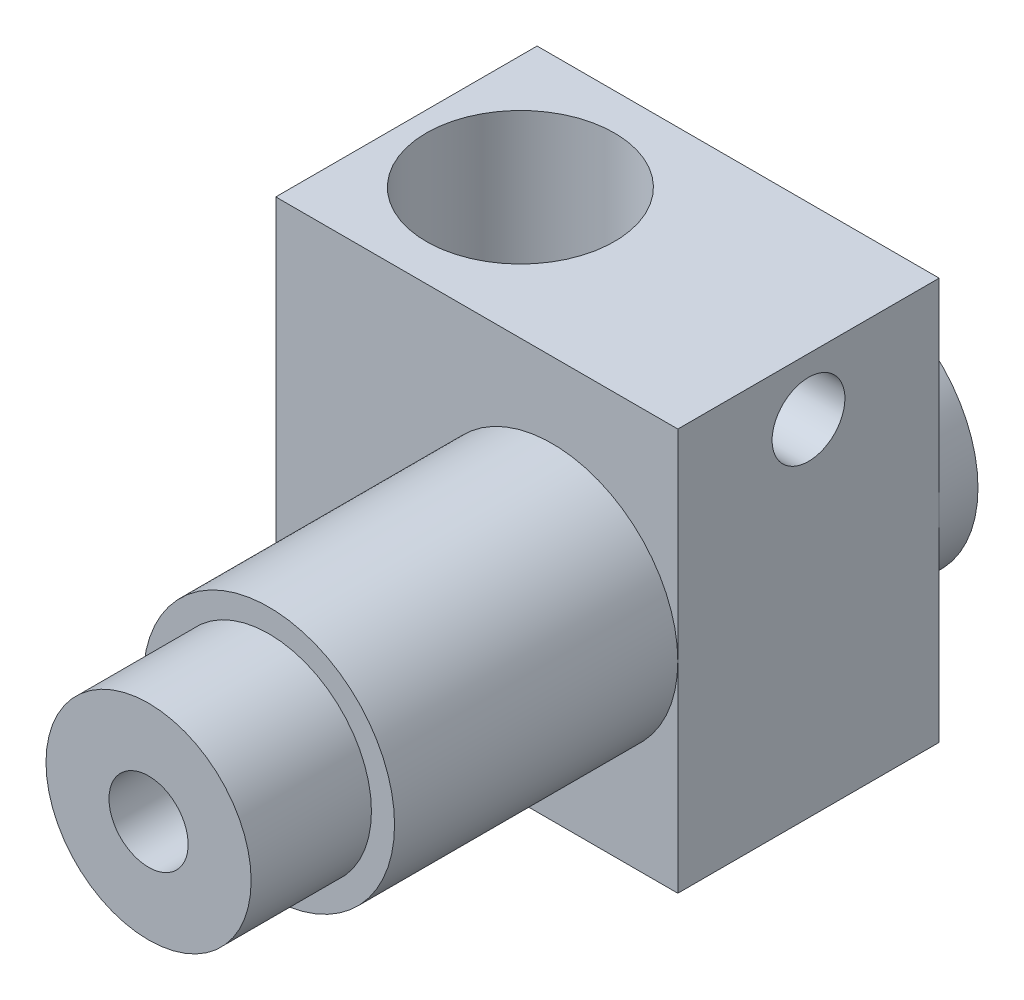
ISO-10303-21;
HEADER;
FILE_DESCRIPTION(('STEP AP214'),'2;1');
FILE_NAME('part.step','',(''),(''),'','','');
FILE_SCHEMA(('AUTOMOTIVE_DESIGN { 1 0 10303 214 1 1 1 1 }'));
ENDSEC;
DATA;
#1=APPLICATION_CONTEXT('core data for automotive mechanical design processes');
#2=APPLICATION_PROTOCOL_DEFINITION('international standard','automotive_design',2000,#1);
#3=PRODUCT_CONTEXT('',#1,'mechanical');
#4=PRODUCT('Part','Part','',(#3));
#5=PRODUCT_RELATED_PRODUCT_CATEGORY('part','',(#4));
#6=PRODUCT_DEFINITION_FORMATION('','',#4);
#7=PRODUCT_DEFINITION_CONTEXT('part definition',#1,'design');
#8=PRODUCT_DEFINITION('design','',#6,#7);
#9=PRODUCT_DEFINITION_SHAPE('','',#8);
#10=(LENGTH_UNIT() NAMED_UNIT(*) SI_UNIT(.MILLI.,.METRE.));
#11=(NAMED_UNIT(*) PLANE_ANGLE_UNIT() SI_UNIT($,.RADIAN.));
#12=(NAMED_UNIT(*) SI_UNIT($,.STERADIAN.) SOLID_ANGLE_UNIT());
#13=UNCERTAINTY_MEASURE_WITH_UNIT(LENGTH_MEASURE(1.E-05),#10,'distance_accuracy_value','');
#14=(GEOMETRIC_REPRESENTATION_CONTEXT(3) GLOBAL_UNCERTAINTY_ASSIGNED_CONTEXT((#13)) GLOBAL_UNIT_ASSIGNED_CONTEXT((#10,
#11,#12)) REPRESENTATION_CONTEXT('',''));
#15=CARTESIAN_POINT('',(0.,0.,0.));
#16=DIRECTION('',(0.,0.,1.));
#17=DIRECTION('',(1.,0.,0.));
#18=AXIS2_PLACEMENT_3D('',#15,#16,#17);
#19=CARTESIAN_POINT('',(-35.4337723682561,8.98403432128964,12.5942984206183));
#20=DIRECTION('',(0.,0.,-1.));
#21=DIRECTION('',(-1.,0.,0.));
#22=AXIS2_PLACEMENT_3D('',#19,#20,#21);
#23=CYLINDRICAL_SURFACE('',#22,1.25);
#24=CARTESIAN_POINT('',(-35.4337723682561,8.98403432128964,33.5972984192473));
#25=DIRECTION('',(0.,0.,-1.));
#26=DIRECTION('',(-1.,0.,0.));
#27=AXIS2_PLACEMENT_3D('',#24,#25,#26);
#28=CIRCLE('',#27,1.25);
#29=CARTESIAN_POINT('',(-36.6837723682561,8.98403432128964,33.5972984192473));
#30=VERTEX_POINT('',#29);
#31=EDGE_CURVE('E39',#30,#30,#28,.F.);
#32=ORIENTED_EDGE('',*,*,#31,.T.);
#33=EDGE_LOOP('',(#32));
#34=FACE_BOUND('',#33,.T.);
#35=CARTESIAN_POINT('',(-35.4337723682561,8.98403432128964,11.2860520131569));
#36=DIRECTION('',(0.,0.,1.));
#37=DIRECTION('',(1.,0.,0.));
#38=AXIS2_PLACEMENT_3D('',#35,#36,#37);
#39=CIRCLE('',#38,1.24999999997044);
#40=CARTESIAN_POINT('',(-34.1837723682857,8.98403432128964,11.2860520131569));
#41=VERTEX_POINT('',#40);
#42=EDGE_CURVE('E139',#41,#41,#39,.F.);
#43=ORIENTED_EDGE('',*,*,#42,.T.);
#44=EDGE_LOOP('',(#43));
#45=FACE_BOUND('',#44,.T.);
#46=ADVANCED_FACE('F36',(#34,#45),#23,.F.);
#47=CARTESIAN_POINT('',(-35.4337723682561,8.98403432128964,11.2860520131569));
#48=DIRECTION('',(0.,0.,1.));
#49=DIRECTION('',(1.,0.,0.));
#50=AXIS2_PLACEMENT_3D('',#47,#48,#49);
#51=CONICAL_SURFACE('',#50,1.24999999997044,0.698131700833495);
#52=CARTESIAN_POINT('',(-35.4337723682561,8.98403432128964,10.0942984206183));
#53=DIRECTION('',(0.,0.,-1.));
#54=DIRECTION('',(-1.,0.,0.));
#55=AXIS2_PLACEMENT_3D('',#52,#53,#54);
#56=CIRCLE('',#55,0.25);
#57=CARTESIAN_POINT('',(-35.1837723683116,8.98403432128964,10.0942984206183));
#58=VERTEX_POINT('',#57);
#59=EDGE_CURVE('E131',#58,#58,#56,.T.);
#60=CARTESIAN_POINT('',(-34.1837723682857,8.98403432128964,11.2860520131569));
#61=CARTESIAN_POINT('',(-34.1941890349526,8.98403432128964,11.2736379132346));
#62=CARTESIAN_POINT('',(-34.2046057016195,8.98403432128964,11.2612238133123));
#63=CARTESIAN_POINT('',(-34.2254390349534,8.98403432128964,11.2363956134678));
#64=CARTESIAN_POINT('',(-34.2358557016204,8.98403432128964,11.2239815135455));
#65=CARTESIAN_POINT('',(-34.2566890349542,8.98403432128964,11.1991533137009));
#66=CARTESIAN_POINT('',(-34.2671057016212,8.98403432128964,11.1867392137786));
#67=CARTESIAN_POINT('',(-34.287939034955,8.98403432128964,11.1619110139341));
#68=CARTESIAN_POINT('',(-34.298355701622,8.98403432128964,11.1494969140118));
#69=CARTESIAN_POINT('',(-34.3191890349558,8.98403432128964,11.1246687141673));
#70=CARTESIAN_POINT('',(-34.3296057016228,8.98403432128964,11.112254614245));
#71=CARTESIAN_POINT('',(-34.3504390349567,8.98403432128964,11.0874264144004));
#72=CARTESIAN_POINT('',(-34.3608557016236,8.98403432128964,11.0750123144782));
#73=CARTESIAN_POINT('',(-34.3816890349575,8.98403432128964,11.0501841146336));
#74=CARTESIAN_POINT('',(-34.3921057016244,8.98403432128964,11.0377700147113));
#75=CARTESIAN_POINT('',(-34.4129390349583,8.98403432128964,11.0129418148668));
#76=CARTESIAN_POINT('',(-34.4233557016252,8.98403432128964,11.0005277149445));
#77=CARTESIAN_POINT('',(-34.4441890349591,8.98403432128964,10.9756995150999));
#78=CARTESIAN_POINT('',(-34.454605701626,8.98403432128964,10.9632854151777));
#79=CARTESIAN_POINT('',(-34.4754390349599,8.98403432128964,10.9384572153331));
#80=CARTESIAN_POINT('',(-34.4858557016268,8.98403432128964,10.9260431154108));
#81=CARTESIAN_POINT('',(-34.5066890349607,8.98403432128964,10.9012149155663));
#82=CARTESIAN_POINT('',(-34.5171057016276,8.98403432128964,10.888800815644));
#83=CARTESIAN_POINT('',(-34.5379390349615,8.98403432128964,10.8639726157994));
#84=CARTESIAN_POINT('',(-34.5483557016285,8.98403432128964,10.8515585158772));
#85=CARTESIAN_POINT('',(-34.5691890349623,8.98403432128964,10.8267303160326));
#86=CARTESIAN_POINT('',(-34.5796057016293,8.98403432128964,10.8143162161103));
#87=CARTESIAN_POINT('',(-34.6004390349631,8.98403432128964,10.7894880162658));
#88=CARTESIAN_POINT('',(-34.6108557016301,8.98403432128964,10.7770739163435));
#89=CARTESIAN_POINT('',(-34.631689034964,8.98403432128964,10.752245716499));
#90=CARTESIAN_POINT('',(-34.6421057016309,8.98403432128964,10.7398316165767));
#91=CARTESIAN_POINT('',(-34.6629390349648,8.98403432128964,10.7150034167321));
#92=CARTESIAN_POINT('',(-34.6733557016317,8.98403432128964,10.7025893168098));
#93=CARTESIAN_POINT('',(-34.6941890349656,8.98403432128964,10.6777611169653));
#94=CARTESIAN_POINT('',(-34.7046057016325,8.98403432128964,10.665347017043));
#95=CARTESIAN_POINT('',(-34.7254390349664,8.98403432128964,10.6405188171985));
#96=CARTESIAN_POINT('',(-34.7358557016333,8.98403432128964,10.6281047172762));
#97=CARTESIAN_POINT('',(-34.7566890349672,8.98403432128964,10.6032765174316));
#98=CARTESIAN_POINT('',(-34.7671057016341,8.98403432128964,10.5908624175094));
#99=CARTESIAN_POINT('',(-34.787939034968,8.98403432128964,10.5660342176648));
#100=CARTESIAN_POINT('',(-34.798355701635,8.98403432128964,10.5536201177425));
#101=CARTESIAN_POINT('',(-34.8191890349688,8.98403432128964,10.528791917898));
#102=CARTESIAN_POINT('',(-34.8296057016358,8.98403432128964,10.5163778179757));
#103=CARTESIAN_POINT('',(-34.8504390349696,8.98403432128964,10.4915496181311));
#104=CARTESIAN_POINT('',(-34.8608557016366,8.98403432128964,10.4791355182089));
#105=CARTESIAN_POINT('',(-34.8816890349704,8.98403432128964,10.4543073183643));
#106=CARTESIAN_POINT('',(-34.8921057016374,8.98403432128964,10.441893218442));
#107=CARTESIAN_POINT('',(-34.9129390349713,8.98403432128964,10.4170650185975));
#108=CARTESIAN_POINT('',(-34.9233557016382,8.98403432128964,10.4046509186752));
#109=CARTESIAN_POINT('',(-34.9441890349721,8.98403432128964,10.3798227188306));
#110=CARTESIAN_POINT('',(-34.954605701639,8.98403432128964,10.3674086189084));
#111=CARTESIAN_POINT('',(-34.9754390349729,8.98403432128964,10.3425804190638));
#112=CARTESIAN_POINT('',(-34.9858557016398,8.98403432128964,10.3301663191415));
#113=CARTESIAN_POINT('',(-35.0066890349737,8.98403432128964,10.305338119297));
#114=CARTESIAN_POINT('',(-35.0171057016406,8.98403432128964,10.2929240193747));
#115=CARTESIAN_POINT('',(-35.0379390349745,8.98403432128964,10.2680958195302));
#116=CARTESIAN_POINT('',(-35.0483557016414,8.98403432128964,10.2556817196079));
#117=CARTESIAN_POINT('',(-35.0691890349753,8.98403432128964,10.2308535197633));
#118=CARTESIAN_POINT('',(-35.0796057016423,8.98403432128964,10.218439419841));
#119=CARTESIAN_POINT('',(-35.1004390349761,8.98403432128964,10.1936112199965));
#120=CARTESIAN_POINT('',(-35.1108557016431,8.98403432128964,10.1811971200742));
#121=CARTESIAN_POINT('',(-35.1316890349769,8.98403432128964,10.1563689202297));
#122=CARTESIAN_POINT('',(-35.1421057016439,8.98403432128964,10.1439548203074));
#123=CARTESIAN_POINT('',(-35.1629390349777,8.98403432128964,10.1191266204628));
#124=CARTESIAN_POINT('',(-35.1733557016447,8.98403432128964,10.1067125205406));
#125=CARTESIAN_POINT('',(-35.1837723683116,8.98403432128964,10.0942984206183));
#126=B_SPLINE_CURVE_WITH_KNOTS('',3,(#60,#61,#62,#63,#64,#65,#66,#67,#68,#69,#70,#71,#72,#73,
#74,#75,#76,#77,#78,#79,#80,#81,#82,#83,#84,#85,#86,#87,#88,#89,#90,#91,#92,#93,#94,#95,#96,#97,
#98,#99,#100,#101,#102,#103,#104,#105,#106,#107,#108,#109,#110,#111,#112,#113,#114,#115,#116,
#117,#118,#119,#120,#121,#122,#123,#124,#125),.UNSPECIFIED.,.F.,.F.,(4,2,2,2,2,2,2,2,2,2,2,2,2,
2,2,2,2,2,2,2,2,2,2,2,2,2,2,2,2,2,2,2,4),(0.,0.0486163695885792,0.0972327391771553,
0.145849108765731,0.194465478354312,0.243081847942888,0.291698217531464,0.340314587120045,
0.388930956708621,0.437547326297201,0.486163695885777,0.534780065474353,0.583396435062934,
0.63201280465151,0.68062917424009,0.729245543828666,0.777861913417242,0.826478283005822,
0.875094652594398,0.923711022182978,0.972327391771554,1.02094376136013,1.06956013094871,
1.11817650053729,1.16679287012587,1.21540923971444,1.26402560930302,1.3126419788916,
1.36125834848018,1.40987471806876,1.45849108765733,1.50710745724591,1.55572382683449),.UNSPECIFIED.);
#127=EDGE_CURVE('BSEAM222',#41,#58,#126,.T.);
#128=ORIENTED_EDGE('',*,*,#42,.F.);
#129=ORIENTED_EDGE('',*,*,#59,.T.);
#130=ORIENTED_EDGE('',*,*,#127,.T.);
#131=ORIENTED_EDGE('',*,*,#127,.F.);
#132=EDGE_LOOP('',(#128,#130,#129,#131));
#133=FACE_BOUND('',#132,.T.);
#134=ADVANCED_FACE('F222',(#133),#51,.F.);
#135=CARTESIAN_POINT('',(-32.1937723682561,8.98403432128964,33.5972984192473));
#136=DIRECTION('',(0.,0.,-1.));
#137=DIRECTION('',(-1.,0.,0.));
#138=AXIS2_PLACEMENT_3D('',#135,#136,#137);
#139=PLANE('',#138);
#140=ORIENTED_EDGE('',*,*,#31,.F.);
#141=EDGE_LOOP('',(#140));
#142=FACE_BOUND('',#141,.T.);
#143=CARTESIAN_POINT('',(-35.4337723682561,8.98403432128964,33.5972984192473));
#144=DIRECTION('',(0.,0.,-1.));
#145=DIRECTION('',(-1.,0.,0.));
#146=AXIS2_PLACEMENT_3D('',#143,#144,#145);
#147=CIRCLE('',#146,3.24);
#148=CARTESIAN_POINT('',(-38.6737723682561,8.98403432128964,33.5972984192473));
#149=VERTEX_POINT('',#148);
#150=EDGE_CURVE('E129',#149,#149,#147,.T.);
#151=ORIENTED_EDGE('',*,*,#150,.F.);
#152=EDGE_LOOP('',(#151));
#153=FACE_BOUND('',#152,.T.);
#154=ADVANCED_FACE('F219',(#142,#153),#139,.F.);
#155=CARTESIAN_POINT('',(-35.4337723682561,8.98403432128964,12.5942984206183));
#156=DIRECTION('',(0.,0.,-1.));
#157=DIRECTION('',(-1.,0.,0.));
#158=AXIS2_PLACEMENT_3D('',#155,#156,#157);
#159=CYLINDRICAL_SURFACE('',#158,0.25);
#160=ORIENTED_EDGE('',*,*,#59,.F.);
#161=EDGE_LOOP('',(#160));
#162=FACE_BOUND('',#161,.T.);
#163=CARTESIAN_POINT('',(-35.4337723682561,8.98403432128964,9.59429842061827));
#164=DIRECTION('',(0.,0.,-1.));
#165=DIRECTION('',(-1.,0.,0.));
#166=AXIS2_PLACEMENT_3D('',#163,#164,#165);
#167=CIRCLE('',#166,0.25);
#168=CARTESIAN_POINT('',(-35.6837723682561,8.98403432128964,9.59429842061827));
#169=VERTEX_POINT('',#168);
#170=EDGE_CURVE('E127',#169,#169,#167,.T.);
#171=ORIENTED_EDGE('',*,*,#170,.T.);
#172=EDGE_LOOP('',(#171));
#173=FACE_BOUND('',#172,.T.);
#174=ADVANCED_FACE('F215',(#162,#173),#159,.F.);
#175=CARTESIAN_POINT('',(-35.4337723682561,8.98403432128964,12.5942984206183));
#176=DIRECTION('',(0.,0.,-1.));
#177=DIRECTION('',(-1.,0.,0.));
#178=AXIS2_PLACEMENT_3D('',#175,#176,#177);
#179=CYLINDRICAL_SURFACE('',#178,3.24);
#180=CARTESIAN_POINT('',(-35.4337723682561,8.98403432128964,29.7972984192473));
#181=DIRECTION('',(0.,0.,-1.));
#182=DIRECTION('',(-1.,0.,0.));
#183=AXIS2_PLACEMENT_3D('',#180,#181,#182);
#184=CIRCLE('',#183,3.24);
#185=CARTESIAN_POINT('',(-38.6737723682561,8.98403432128964,29.7972984192473));
#186=VERTEX_POINT('',#185);
#187=EDGE_CURVE('E124',#186,#186,#184,.F.);
#188=ORIENTED_EDGE('',*,*,#187,.T.);
#189=EDGE_LOOP('',(#188));
#190=FACE_BOUND('',#189,.T.);
#191=ORIENTED_EDGE('',*,*,#150,.T.);
#192=EDGE_LOOP('',(#191));
#193=FACE_BOUND('',#192,.T.);
#194=ADVANCED_FACE('F211',(#190,#193),#179,.T.);
#195=CARTESIAN_POINT('',(-35.1837723682561,8.98403432128964,9.59429842061827));
#196=DIRECTION('',(0.,0.,1.));
#197=DIRECTION('',(1.,0.,0.));
#198=AXIS2_PLACEMENT_3D('',#195,#196,#197);
#199=PLANE('',#198);
#200=CARTESIAN_POINT('',(-35.4337723682561,8.98403432128964,9.59429842054891));
#201=DIRECTION('',(0.,0.,1.));
#202=DIRECTION('',(1.,0.,0.));
#203=AXIS2_PLACEMENT_3D('',#200,#201,#202);
#204=CIRCLE('',#203,0.634999999931551);
#205=CARTESIAN_POINT('',(-34.7987723683246,8.98403432128964,9.59429842054891));
#206=VERTEX_POINT('',#205);
#207=EDGE_CURVE('E121',#206,#206,#204,.T.);
#208=ORIENTED_EDGE('',*,*,#207,.F.);
#209=EDGE_LOOP('',(#208));
#210=FACE_BOUND('',#209,.T.);
#211=ORIENTED_EDGE('',*,*,#170,.F.);
#212=EDGE_LOOP('',(#211));
#213=FACE_BOUND('',#212,.T.);
#214=ADVANCED_FACE('F207',(#210,#213),#199,.F.);
#215=CARTESIAN_POINT('',(-31.4637723682561,8.98403432128964,29.7972984192473));
#216=DIRECTION('',(0.,0.,-1.));
#217=DIRECTION('',(-1.,0.,0.));
#218=AXIS2_PLACEMENT_3D('',#215,#216,#217);
#219=PLANE('',#218);
#220=ORIENTED_EDGE('',*,*,#187,.F.);
#221=EDGE_LOOP('',(#220));
#222=FACE_BOUND('',#221,.T.);
#223=CARTESIAN_POINT('',(-35.4337723682561,8.98403432128964,29.7972984192473));
#224=DIRECTION('',(0.,0.,-1.));
#225=DIRECTION('',(-1.,0.,0.));
#226=AXIS2_PLACEMENT_3D('',#223,#224,#225);
#227=CIRCLE('',#226,3.97);
#228=CARTESIAN_POINT('',(-39.4037723682561,8.98403432128964,29.7972984192473));
#229=VERTEX_POINT('',#228);
#230=EDGE_CURVE('E118',#229,#229,#227,.T.);
#231=ORIENTED_EDGE('',*,*,#230,.F.);
#232=EDGE_LOOP('',(#231));
#233=FACE_BOUND('',#232,.T.);
#234=ADVANCED_FACE('F203',(#222,#233),#219,.F.);
#235=CARTESIAN_POINT('',(-35.4337723682561,8.98403432128964,11.3675493751891));
#236=DIRECTION('',(0.,0.,1.));
#237=DIRECTION('',(1.,0.,0.));
#238=AXIS2_PLACEMENT_3D('',#235,#236,#237);
#239=CONICAL_SURFACE('',#238,3.970000000038,1.08210413623823);
#240=CARTESIAN_POINT('',(-35.4337723682561,8.98403432128964,11.3675493752093));
#241=DIRECTION('',(0.,0.,-1.));
#242=DIRECTION('',(-1.,0.,0.));
#243=AXIS2_PLACEMENT_3D('',#240,#241,#242);
#244=CIRCLE('',#243,3.97);
#245=CARTESIAN_POINT('',(-31.4637723681801,8.98403432128964,11.3675493752093));
#246=VERTEX_POINT('',#245);
#247=EDGE_CURVE('E86',#246,#246,#244,.F.);
#248=CARTESIAN_POINT('',(-31.4637723681801,8.98403432128964,11.3675493752093));
#249=CARTESIAN_POINT('',(-31.4985119515149,8.98403432128964,11.3490780110983));
#250=CARTESIAN_POINT('',(-31.5332515348498,8.98403432128964,11.3306066469872));
#251=CARTESIAN_POINT('',(-31.6027307015194,8.98403432128964,11.2936639187651));
#252=CARTESIAN_POINT('',(-31.6374702848543,8.98403432128964,11.2751925546541));
#253=CARTESIAN_POINT('',(-31.7069494515239,8.98403432128964,11.238249826432));
#254=CARTESIAN_POINT('',(-31.7416890348588,8.98403432128964,11.2197784623209));
#255=CARTESIAN_POINT('',(-31.8111682015285,8.98403432128964,11.1828357340989));
#256=CARTESIAN_POINT('',(-31.8459077848633,8.98403432128964,11.1643643699878));
#257=CARTESIAN_POINT('',(-31.915386951533,8.98403432128964,11.1274216417657));
#258=CARTESIAN_POINT('',(-31.9501265348678,8.98403432128964,11.1089502776547));
#259=CARTESIAN_POINT('',(-32.0196057015375,8.98403432128964,11.0720075494326));
#260=CARTESIAN_POINT('',(-32.0543452848723,8.98403432128964,11.0535361853215));
#261=CARTESIAN_POINT('',(-32.123824451542,8.98403432128964,11.0165934570994));
#262=CARTESIAN_POINT('',(-32.1585640348768,8.98403432128964,10.9981220929884));
#263=CARTESIAN_POINT('',(-32.2280432015465,8.98403432128964,10.9611793647663));
#264=CARTESIAN_POINT('',(-32.2627827848814,8.98403432128964,10.9427080006553));
#265=CARTESIAN_POINT('',(-32.332261951551,8.98403432128964,10.9057652724332));
#266=CARTESIAN_POINT('',(-32.3670015348859,8.98403432128964,10.8872939083221));
#267=CARTESIAN_POINT('',(-32.4364807015555,8.98403432128964,10.8503511801));
#268=CARTESIAN_POINT('',(-32.4712202848904,8.98403432128964,10.831879815989));
#269=CARTESIAN_POINT('',(-32.5406994515601,8.98403432128964,10.7949370877669));
#270=CARTESIAN_POINT('',(-32.5754390348949,8.98403432128964,10.7764657236558));
#271=CARTESIAN_POINT('',(-32.6449182015646,8.98403432128964,10.7395229954338));
#272=CARTESIAN_POINT('',(-32.6796577848994,8.98403432128964,10.7210516313227));
#273=CARTESIAN_POINT('',(-32.7491369515691,8.98403432128964,10.6841089031006));
#274=CARTESIAN_POINT('',(-32.7838765349039,8.98403432128964,10.6656375389896));
#275=CARTESIAN_POINT('',(-32.8533557015736,8.98403432128964,10.6286948107675));
#276=CARTESIAN_POINT('',(-32.8880952849085,8.98403432128964,10.6102234466564));
#277=CARTESIAN_POINT('',(-32.9575744515781,8.98403432128964,10.5732807184343));
#278=CARTESIAN_POINT('',(-32.992314034913,8.98403432128964,10.5548093543233));
#279=CARTESIAN_POINT('',(-33.0617932015826,8.98403432128964,10.5178666261012));
#280=CARTESIAN_POINT('',(-33.0965327849175,8.98403432128964,10.4993952619902));
#281=CARTESIAN_POINT('',(-33.1660119515872,8.98403432128964,10.4624525337681));
#282=CARTESIAN_POINT('',(-33.200751534922,8.98403432128964,10.443981169657));
#283=CARTESIAN_POINT('',(-33.2702307015917,8.98403432128964,10.4070384414349));
#284=CARTESIAN_POINT('',(-33.3049702849265,8.98403432128964,10.3885670773239));
#285=CARTESIAN_POINT('',(-33.3744494515962,8.98403432128964,10.3516243491018));
#286=CARTESIAN_POINT('',(-33.409189034931,8.98403432128964,10.3331529849907));
#287=CARTESIAN_POINT('',(-33.4786682016007,8.98403432128964,10.2962102567686));
#288=CARTESIAN_POINT('',(-33.5134077849355,8.98403432128964,10.2777388926576));
#289=CARTESIAN_POINT('',(-33.5828869516052,8.98403432128964,10.2407961644355));
#290=CARTESIAN_POINT('',(-33.6176265349401,8.98403432128964,10.2223248003245));
#291=CARTESIAN_POINT('',(-33.6871057016097,8.98403432128964,10.1853820721024));
#292=CARTESIAN_POINT('',(-33.7218452849446,8.98403432128964,10.1669107079913));
#293=CARTESIAN_POINT('',(-33.7913244516142,8.98403432128964,10.1299679797692));
#294=CARTESIAN_POINT('',(-33.8260640349491,8.98403432128964,10.1114966156582));
#295=CARTESIAN_POINT('',(-33.8955432016188,8.98403432128964,10.0745538874361));
#296=CARTESIAN_POINT('',(-33.9302827849536,8.98403432128964,10.0560825233251));
#297=CARTESIAN_POINT('',(-33.9997619516233,8.98403432128964,10.019139795103));
#298=CARTESIAN_POINT('',(-34.0345015349581,8.98403432128964,10.0006684309919));
#299=CARTESIAN_POINT('',(-34.1039807016278,8.98403432128964,9.96372570276982));
#300=CARTESIAN_POINT('',(-34.1387202849626,8.98403432128964,9.94525433865878));
#301=CARTESIAN_POINT('',(-34.2081994516323,8.98403432128964,9.90831161043669));
#302=CARTESIAN_POINT('',(-34.2429390349672,8.98403432128964,9.88984024632564));
#303=CARTESIAN_POINT('',(-34.3124182016368,8.98403432128964,9.85289751810355));
#304=CARTESIAN_POINT('',(-34.3471577849717,8.98403432128964,9.8344261539925));
#305=CARTESIAN_POINT('',(-34.4166369516413,8.98403432128964,9.79748342577041));
#306=CARTESIAN_POINT('',(-34.4513765349762,8.98403432128964,9.77901206165937));
#307=CARTESIAN_POINT('',(-34.5208557016458,8.98403432128964,9.74206933343727));
#308=CARTESIAN_POINT('',(-34.5555952849807,8.98403432128964,9.72359796932623));
#309=CARTESIAN_POINT('',(-34.6250744516504,8.98403432128964,9.68665524110414));
#310=CARTESIAN_POINT('',(-34.6598140349852,8.98403432128964,9.66818387699309));
#311=CARTESIAN_POINT('',(-34.7292932016549,8.98403432128964,9.631241148771));
#312=CARTESIAN_POINT('',(-34.7640327849897,8.98403432128964,9.61276978465995));
#313=CARTESIAN_POINT('',(-34.7987723683246,8.98403432128964,9.59429842054891));
#314=B_SPLINE_CURVE_WITH_KNOTS('',3,(#248,#249,#250,#251,#252,#253,#254,#255,#256,#257,#258,
#259,#260,#261,#262,#263,#264,#265,#266,#267,#268,#269,#270,#271,#272,#273,#274,#275,#276,#277,
#278,#279,#280,#281,#282,#283,#284,#285,#286,#287,#288,#289,#290,#291,#292,#293,#294,#295,#296,
#297,#298,#299,#300,#301,#302,#303,#304,#305,#306,#307,#308,#309,#310,#311,#312,#313),
.UNSPECIFIED.,.F.,.F.,(4,2,2,2,2,2,2,2,2,2,2,2,2,2,2,2,2,2,2,2,2,2,2,2,2,2,2,2,2,2,2,2,4),(0.,
0.118035034975257,0.236070069950508,0.354105104925759,0.472140139901016,0.590175174876267,
0.708210209851518,0.826245244826775,0.944280279802025,1.06231531477728,1.18035034975253,
1.29838538472778,1.41642041970303,1.53445545467829,1.65249048965354,1.77052552462879,
1.88856055960404,2.0065955945793,2.12463062955455,2.2426656645298,2.36070069950506,
2.47873573448031,2.59677076945556,2.71480580443081,2.83284083940607,2.95087587438132,
3.06891090935657,3.18694594433183,3.30498097930708,3.42301601428233,3.54105104925758,
3.65908608423284,3.77712111920809),.UNSPECIFIED.);
#315=EDGE_CURVE('BSEAM199',#246,#206,#314,.T.);
#316=ORIENTED_EDGE('',*,*,#247,.F.);
#317=ORIENTED_EDGE('',*,*,#207,.T.);
#318=ORIENTED_EDGE('',*,*,#315,.T.);
#319=ORIENTED_EDGE('',*,*,#315,.F.);
#320=EDGE_LOOP('',(#316,#318,#317,#319));
#321=FACE_BOUND('',#320,.T.);
#322=ADVANCED_FACE('F199',(#321),#239,.T.);
#323=CARTESIAN_POINT('',(-35.4337723682561,8.98403432128964,12.5942984206183));
#324=DIRECTION('',(0.,0.,-1.));
#325=DIRECTION('',(-1.,0.,0.));
#326=AXIS2_PLACEMENT_3D('',#323,#324,#325);
#327=CYLINDRICAL_SURFACE('',#326,3.97);
#328=CARTESIAN_POINT('',(-35.4337723682561,8.98403432128964,20.8492984206183));
#329=DIRECTION('',(0.,0.,-1.));
#330=DIRECTION('',(-1.,0.,0.));
#331=AXIS2_PLACEMENT_3D('',#328,#329,#330);
#332=CIRCLE('',#331,3.97);
#333=CARTESIAN_POINT('',(-39.4037723682561,8.98403432128964,20.8492984206183));
#334=VERTEX_POINT('',#333);
#335=EDGE_CURVE('E85',#334,#334,#332,.T.);
#336=ORIENTED_EDGE('',*,*,#335,.F.);
#337=EDGE_LOOP('',(#336));
#338=FACE_BOUND('',#337,.T.);
#339=ORIENTED_EDGE('',*,*,#230,.T.);
#340=EDGE_LOOP('',(#339));
#341=FACE_BOUND('',#340,.T.);
#342=ADVANCED_FACE('F195',(#338,#341),#327,.T.);
#343=CARTESIAN_POINT('',(-35.4337723682561,8.98403432128964,12.5942984206183));
#344=DIRECTION('',(0.,0.,-1.));
#345=DIRECTION('',(-1.,0.,0.));
#346=AXIS2_PLACEMENT_3D('',#343,#344,#345);
#347=CYLINDRICAL_SURFACE('',#346,3.97);
#348=ORIENTED_EDGE('',*,*,#247,.T.);
#349=EDGE_LOOP('',(#348));
#350=FACE_BOUND('',#349,.T.);
#351=CARTESIAN_POINT('',(-35.4337723682561,8.98403432128964,12.5942984206183));
#352=DIRECTION('',(0.,0.,-1.));
#353=DIRECTION('',(-1.,0.,0.));
#354=AXIS2_PLACEMENT_3D('',#351,#352,#353);
#355=CIRCLE('',#354,3.97);
#356=CARTESIAN_POINT('',(-39.4037723682561,8.98403432128964,12.5942984206183));
#357=VERTEX_POINT('',#356);
#358=EDGE_CURVE('E109',#357,#357,#355,.T.);
#359=ORIENTED_EDGE('',*,*,#358,.T.);
#360=EDGE_LOOP('',(#359));
#361=FACE_BOUND('',#360,.T.);
#362=ADVANCED_FACE('F192',(#350,#361),#347,.T.);
#363=CARTESIAN_POINT('',(-44.1637723682561,15.3340343212896,20.8492984206183));
#364=DIRECTION('',(1.,0.,0.));
#365=DIRECTION('',(0.,0.,-1.));
#366=AXIS2_PLACEMENT_3D('',#363,#364,#365);
#367=PLANE('',#366);
#368=DIRECTION('',(0.,0.,1.));
#369=VECTOR('',#368,1.);
#370=CARTESIAN_POINT('',(-44.1637723682561,2.63403432128964,20.8492984206183));
#371=LINE('',#370,#369);
#372=CARTESIAN_POINT('',(-44.1637723682561,2.63403432128964,12.5942984206183));
#373=VERTEX_POINT('',#372);
#374=CARTESIAN_POINT('',(-44.1637723682561,2.63403432128964,20.8492984206183));
#375=VERTEX_POINT('',#374);
#376=EDGE_CURVE('E80',#373,#375,#371,.T.);
#377=ORIENTED_EDGE('',*,*,#376,.T.);
#378=DIRECTION('',(0.,1.,0.));
#379=VECTOR('',#378,1.);
#380=CARTESIAN_POINT('',(-44.1637723682561,8.98403432128964,20.8492984206183));
#381=LINE('',#380,#379);
#382=CARTESIAN_POINT('',(-44.1637723682561,15.3340343212896,20.8492984206183));
#383=VERTEX_POINT('',#382);
#384=EDGE_CURVE('E75',#383,#375,#381,.F.);
#385=ORIENTED_EDGE('',*,*,#384,.F.);
#386=DIRECTION('',(0.,0.,1.));
#387=VECTOR('',#386,1.);
#388=CARTESIAN_POINT('',(-44.1637723682561,15.3340343212896,20.8492984206183));
#389=LINE('',#388,#387);
#390=CARTESIAN_POINT('',(-44.1637723682561,15.3340343212896,12.5942984206183));
#391=VERTEX_POINT('',#390);
#392=EDGE_CURVE('E79',#383,#391,#389,.F.);
#393=ORIENTED_EDGE('',*,*,#392,.T.);
#394=DIRECTION('',(0.,1.,0.));
#395=VECTOR('',#394,1.);
#396=CARTESIAN_POINT('',(-44.1637723682561,15.3340343212896,12.5942984206183));
#397=LINE('',#396,#395);
#398=EDGE_CURVE('E113',#391,#373,#397,.F.);
#399=ORIENTED_EDGE('',*,*,#398,.T.);
#400=EDGE_LOOP('',(#377,#385,#393,#399));
#401=FACE_BOUND('',#400,.T.);
#402=ADVANCED_FACE('F77',(#401),#367,.F.);
#403=CARTESIAN_POINT('',(-35.4337723682561,8.98403432128964,20.8492984206183));
#404=DIRECTION('',(0.,0.,1.));
#405=DIRECTION('',(1.,0.,0.));
#406=AXIS2_PLACEMENT_3D('',#403,#404,#405);
#407=PLANE('',#406);
#408=ORIENTED_EDGE('',*,*,#335,.T.);
#409=EDGE_LOOP('',(#408));
#410=FACE_BOUND('',#409,.T.);
#411=ORIENTED_EDGE('',*,*,#384,.T.);
#412=DIRECTION('',(1.,0.,0.));
#413=VECTOR('',#412,1.);
#414=CARTESIAN_POINT('',(-35.4337723682561,2.63403432128964,20.8492984206183));
#415=LINE('',#414,#413);
#416=CARTESIAN_POINT('',(-31.4637723682561,2.63403432128964,20.8492984206183));
#417=VERTEX_POINT('',#416);
#418=EDGE_CURVE('E353',#375,#417,#415,.T.);
#419=ORIENTED_EDGE('',*,*,#418,.T.);
#420=DIRECTION('',(0.,1.,0.));
#421=VECTOR('',#420,1.);
#422=CARTESIAN_POINT('',(-31.4637723682561,8.98403432128964,20.8492984206183));
#423=LINE('',#422,#421);
#424=CARTESIAN_POINT('',(-31.4637723682561,15.3340343212896,20.8492984206183));
#425=VERTEX_POINT('',#424);
#426=EDGE_CURVE('E99',#417,#425,#423,.T.);
#427=ORIENTED_EDGE('',*,*,#426,.T.);
#428=DIRECTION('',(1.,0.,0.));
#429=VECTOR('',#428,1.);
#430=CARTESIAN_POINT('',(-35.4337723682561,15.3340343212896,20.8492984206183));
#431=LINE('',#430,#429);
#432=EDGE_CURVE('E94',#425,#383,#431,.F.);
#433=ORIENTED_EDGE('',*,*,#432,.T.);
#434=EDGE_LOOP('',(#411,#419,#427,#433));
#435=FACE_BOUND('',#434,.T.);
#436=ADVANCED_FACE('F98',(#410,#435),#407,.T.);
#437=CARTESIAN_POINT('',(-31.4637723682561,2.63403432128964,20.8492984206183));
#438=DIRECTION('',(-1.,0.,0.));
#439=DIRECTION('',(0.,-1.,0.));
#440=AXIS2_PLACEMENT_3D('',#437,#438,#439);
#441=PLANE('',#440);
#442=ORIENTED_EDGE('',*,*,#426,.F.);
#443=DIRECTION('',(0.,0.,1.));
#444=VECTOR('',#443,1.);
#445=CARTESIAN_POINT('',(-31.4637723682561,2.63403432128964,20.8492984206183));
#446=LINE('',#445,#444);
#447=CARTESIAN_POINT('',(-31.4637723682561,2.63403432128964,12.5942984206183));
#448=VERTEX_POINT('',#447);
#449=EDGE_CURVE('E351',#417,#448,#446,.F.);
#450=ORIENTED_EDGE('',*,*,#449,.T.);
#451=DIRECTION('',(0.,-1.,0.));
#452=VECTOR('',#451,1.);
#453=CARTESIAN_POINT('',(-31.4637723682561,2.63403432128964,12.5942984206183));
#454=LINE('',#453,#452);
#455=CARTESIAN_POINT('',(-31.4637723682561,15.3340343212896,12.5942984206183));
#456=VERTEX_POINT('',#455);
#457=EDGE_CURVE('E54',#448,#456,#454,.F.);
#458=ORIENTED_EDGE('',*,*,#457,.T.);
#459=DIRECTION('',(0.,0.,1.));
#460=VECTOR('',#459,1.);
#461=CARTESIAN_POINT('',(-31.4637723682561,15.3340343212896,20.8492984206183));
#462=LINE('',#461,#460);
#463=EDGE_CURVE('E100',#456,#425,#462,.T.);
#464=ORIENTED_EDGE('',*,*,#463,.T.);
#465=EDGE_LOOP('',(#442,#450,#458,#464));
#466=FACE_BOUND('',#465,.T.);
#467=CARTESIAN_POINT('',(-31.4637723682561,13.5340343212896,16.7217984206183));
#468=DIRECTION('',(1.,0.,0.));
#469=DIRECTION('',(0.,1.,0.));
#470=AXIS2_PLACEMENT_3D('',#467,#468,#469);
#471=CIRCLE('',#470,1.15);
#472=CARTESIAN_POINT('',(-31.4637723682561,14.6840343212896,16.7217984206183));
#473=VERTEX_POINT('',#472);
#474=EDGE_CURVE('E102',#473,#473,#471,.F.);
#475=ORIENTED_EDGE('',*,*,#474,.T.);
#476=EDGE_LOOP('',(#475));
#477=FACE_BOUND('',#476,.T.);
#478=ADVANCED_FACE('F175',(#466,#477),#441,.F.);
#479=CARTESIAN_POINT('',(-35.4337723682561,8.98403432128964,12.5942984206183));
#480=DIRECTION('',(0.,0.,1.));
#481=DIRECTION('',(1.,0.,0.));
#482=AXIS2_PLACEMENT_3D('',#479,#480,#481);
#483=PLANE('',#482);
#484=ORIENTED_EDGE('',*,*,#358,.F.);
#485=EDGE_LOOP('',(#484));
#486=FACE_BOUND('',#485,.T.);
#487=ORIENTED_EDGE('',*,*,#457,.F.);
#488=DIRECTION('',(1.,0.,0.));
#489=VECTOR('',#488,1.);
#490=CARTESIAN_POINT('',(-35.4337723682561,2.63403432128964,12.5942984206183));
#491=LINE('',#490,#489);
#492=EDGE_CURVE('E153',#448,#373,#491,.F.);
#493=ORIENTED_EDGE('',*,*,#492,.T.);
#494=ORIENTED_EDGE('',*,*,#398,.F.);
#495=DIRECTION('',(1.,0.,0.));
#496=VECTOR('',#495,1.);
#497=CARTESIAN_POINT('',(-35.4337723682561,15.3340343212896,12.5942984206183));
#498=LINE('',#497,#496);
#499=EDGE_CURVE('E96',#391,#456,#498,.T.);
#500=ORIENTED_EDGE('',*,*,#499,.T.);
#501=EDGE_LOOP('',(#487,#493,#494,#500));
#502=FACE_BOUND('',#501,.T.);
#503=ADVANCED_FACE('F170',(#486,#502),#483,.F.);
#504=CARTESIAN_POINT('',(-44.1647723682561,13.5340343212896,16.7217984206183));
#505=DIRECTION('',(1.,0.,0.));
#506=DIRECTION('',(0.,1.,0.));
#507=AXIS2_PLACEMENT_3D('',#504,#505,#506);
#508=CYLINDRICAL_SURFACE('',#507,1.15);
#509=CARTESIAN_POINT('',(-37.5917723682561,12.3840343212896,16.7217984206183));
#510=CARTESIAN_POINT('',(-37.5917751706404,12.3840379226714,16.7838395398682));
#511=CARTESIAN_POINT('',(-37.5937356803063,12.3890791120216,16.8459369152533));
#512=CARTESIAN_POINT('',(-37.6013782497221,12.4090557734074,16.9683360198054));
#513=CARTESIAN_POINT('',(-37.6070658314011,12.4240059266728,17.028634945632));
#514=CARTESIAN_POINT('',(-37.6215487154823,12.4631818407174,17.1455497674124));
#515=CARTESIAN_POINT('',(-37.6303356302591,12.4873825815797,17.2021751201535));
#516=CARTESIAN_POINT('',(-37.6501471577829,12.5442682675967,17.3105347041319));
#517=CARTESIAN_POINT('',(-37.6611716953639,12.576952927771,17.3622690995802));
#518=CARTESIAN_POINT('',(-37.6848820032014,12.651413439881,17.4617268188724));
#519=CARTESIAN_POINT('',(-37.6976169775149,12.6935039338903,17.5092027608265));
#520=CARTESIAN_POINT('',(-37.7230789905179,12.784914789757,17.5966254532314));
#521=CARTESIAN_POINT('',(-37.7358060243813,12.8342378812365,17.6365693479784));
#522=CARTESIAN_POINT('',(-37.7603908750306,12.9411798354484,17.709410260543));
#523=CARTESIAN_POINT('',(-37.7721915157523,12.9990562323313,17.7419504337018));
#524=CARTESIAN_POINT('',(-37.7928192860317,13.1199877629,17.7967245021968));
#525=CARTESIAN_POINT('',(-37.8016476910573,13.1830406607215,17.8189628198859));
#526=CARTESIAN_POINT('',(-37.8148044472947,13.309690078404,17.8515140530501));
#527=CARTESIAN_POINT('',(-37.8193103757534,13.3731460010251,17.8622997092506));
#528=CARTESIAN_POINT('',(-37.8238294245903,13.5011147193401,17.8731170404733));
#529=CARTESIAN_POINT('',(-37.8238445636649,13.565627027126,17.8731535474452));
#530=CARTESIAN_POINT('',(-37.8195326688692,13.6894520542984,17.8628314913126));
#531=CARTESIAN_POINT('',(-37.815485128487,13.7488321284661,17.8531420286044));
#532=CARTESIAN_POINT('',(-37.8039705767475,13.8650467092035,17.8247536358419));
#533=CARTESIAN_POINT('',(-37.7965030039492,13.9218807961352,17.8060532265019));
#534=CARTESIAN_POINT('',(-37.7788302535676,14.0327078157621,17.7598262953235));
#535=CARTESIAN_POINT('',(-37.7685741023388,14.0866228437748,17.7321333520985));
#536=CARTESIAN_POINT('',(-37.7464959678264,14.1892271875061,17.6688250088221));
#537=CARTESIAN_POINT('',(-37.7346734887056,14.2379148395725,17.6332070976047));
#538=CARTESIAN_POINT('',(-37.7097594925687,14.3323633499633,17.5520512981965));
#539=CARTESIAN_POINT('',(-37.6966378018765,14.3776631714703,17.505984824692));
#540=CARTESIAN_POINT('',(-37.6713254139583,14.4600504338175,17.4067466958701));
#541=CARTESIAN_POINT('',(-37.6591351577064,14.4971340003808,17.3535717074854));
#542=CARTESIAN_POINT('',(-37.6367856019269,14.562592890065,17.2403723841253));
#543=CARTESIAN_POINT('',(-37.6266669452017,14.5907988969847,17.1802417182169));
#544=CARTESIAN_POINT('',(-37.60991910815,14.6364960365563,17.0556567606114));
#545=CARTESIAN_POINT('',(-37.6032828997505,14.6540087615443,16.9912114753011));
#546=CARTESIAN_POINT('',(-37.5964622720679,14.6718706519621,16.8920854013457));
#547=CARTESIAN_POINT('',(-37.5947097469698,14.6764250649536,16.8582184160346));
#548=CARTESIAN_POINT('',(-37.5923640260295,14.6825078835778,16.7901727896766));
#549=CARTESIAN_POINT('',(-37.5917708236422,14.6840363062937,16.7559941503901));
#550=CARTESIAN_POINT('',(-37.5917751706404,14.6840307199079,16.6597573013683));
#551=CARTESIAN_POINT('',(-37.5937356803063,14.6789895305577,16.5976599259833));
#552=CARTESIAN_POINT('',(-37.6013782497221,14.6590128691719,16.4752608214311));
#553=CARTESIAN_POINT('',(-37.6070658314011,14.6440627159065,16.4149618956045));
#554=CARTESIAN_POINT('',(-37.6215487154823,14.6048868018618,16.2980470738241));
#555=CARTESIAN_POINT('',(-37.6303356302591,14.5806860609996,16.2414217210831));
#556=CARTESIAN_POINT('',(-37.6501471577829,14.5238003749825,16.1330621371047));
#557=CARTESIAN_POINT('',(-37.6611716953639,14.4911157148083,16.0813277416564));
#558=CARTESIAN_POINT('',(-37.6848820032014,14.4166552026982,15.9818700223641));
#559=CARTESIAN_POINT('',(-37.6976169775149,14.374564708689,15.9343940804101));
#560=CARTESIAN_POINT('',(-37.7230789905179,14.2831538528222,15.8469713880052));
#561=CARTESIAN_POINT('',(-37.7358060243813,14.2338307613428,15.8070274932582));
#562=CARTESIAN_POINT('',(-37.7603908750306,14.1268888071309,15.7341865806935));
#563=CARTESIAN_POINT('',(-37.7721915157523,14.0690124102479,15.7016464075347));
#564=CARTESIAN_POINT('',(-37.7928192860317,13.9480808796793,15.6468723390397));
#565=CARTESIAN_POINT('',(-37.8016476910573,13.8850279818578,15.6246340213507));
#566=CARTESIAN_POINT('',(-37.8148044472947,13.7583785641752,15.5920827881865));
#567=CARTESIAN_POINT('',(-37.8193103757534,13.6949226415542,15.5812971319859));
#568=CARTESIAN_POINT('',(-37.8238294245903,13.5669539232392,15.5704798007632));
#569=CARTESIAN_POINT('',(-37.8238445636649,13.5024416154532,15.5704432937913));
#570=CARTESIAN_POINT('',(-37.8195326688692,13.3786165882808,15.5807653499239));
#571=CARTESIAN_POINT('',(-37.815485128487,13.3192365141132,15.5904548126322));
#572=CARTESIAN_POINT('',(-37.8039705767475,13.2030219333758,15.6188432053947));
#573=CARTESIAN_POINT('',(-37.7965030039492,13.1461878464441,15.6375436147347));
#574=CARTESIAN_POINT('',(-37.7788302535676,13.0353608268172,15.683770545913));
#575=CARTESIAN_POINT('',(-37.7685741023388,12.9814457988045,15.711463489138));
#576=CARTESIAN_POINT('',(-37.7464959678264,12.8788414550732,15.7747718324145));
#577=CARTESIAN_POINT('',(-37.7346734887056,12.8301538030067,15.8103897436318));
#578=CARTESIAN_POINT('',(-37.7097594925687,12.7357052926159,15.8915455430401));
#579=CARTESIAN_POINT('',(-37.6966378018765,12.690405471109,15.9376120165445));
#580=CARTESIAN_POINT('',(-37.6713254139583,12.6080182087618,16.0368501453665));
#581=CARTESIAN_POINT('',(-37.6591351577064,12.5709346421984,16.0900251337512));
#582=CARTESIAN_POINT('',(-37.6367856019269,12.5054757525143,16.2032244571113));
#583=CARTESIAN_POINT('',(-37.6266669452017,12.4772697455945,16.2633551230196));
#584=CARTESIAN_POINT('',(-37.60991910815,12.431572606023,16.3879400806251));
#585=CARTESIAN_POINT('',(-37.6032828997505,12.4140598810349,16.4523853659354));
#586=CARTESIAN_POINT('',(-37.5964622720679,12.3961979906172,16.5515114398909));
#587=CARTESIAN_POINT('',(-37.5947097469698,12.3916435776257,16.5853784252019));
#588=CARTESIAN_POINT('',(-37.5923640260295,12.3855607590015,16.65342405156));
#589=CARTESIAN_POINT('',(-37.5917708236422,12.3840323362855,16.6876026908464));
#590=CARTESIAN_POINT('',(-37.5917723682561,12.3840343212896,16.7217984206183));
#591=B_SPLINE_CURVE_WITH_KNOTS('',3,(#509,#510,#511,#512,#513,#514,#515,#516,#517,#518,#519,
#520,#521,#522,#523,#524,#525,#526,#527,#528,#529,#530,#531,#532,#533,#534,#535,#536,#537,#538,
#539,#540,#541,#542,#543,#544,#545,#546,#547,#548,#549,#550,#551,#552,#553,#554,#555,#556,#557,
#558,#559,#560,#561,#562,#563,#564,#565,#566,#567,#568,#569,#570,#571,#572,#573,#574,#575,#576,
#577,#578,#579,#580,#581,#582,#583,#584,#585,#586,#587,#588,#589,#590),.UNSPECIFIED.,.T.,.F.,(4,
2,2,2,2,2,2,2,2,2,2,2,2,2,2,2,2,2,2,2,2,2,2,2,2,2,2,2,2,2,2,2,2,2,2,2,2,2,2,2,4),(0.,
0.185990763049059,0.372257709900012,0.558024388011692,0.743784826903708,0.937070288173051,
1.13042888508164,1.33172973544974,1.53294409166843,1.72548478199678,1.91793892144235,
2.09800254668943,2.27809574223166,2.46173241958286,2.64542736853347,2.84230969773679,
3.03928466779572,3.23981602588703,3.43994111165494,3.54245579637753,3.64496990234753,
3.83096066539658,4.01722761224754,4.20299429035921,4.38875472925123,4.58204019052058,
4.77539878742916,4.97669963779727,5.17791399401596,5.37045468434431,5.56290882378987,
5.74297244903696,5.92306564457918,6.10670232193038,6.29039727088099,6.48727960008431,
6.68425457014325,6.88478592823456,7.08491101400246,7.18742569872506,7.28993980469505),.UNSPECIFIED.);
#592=CARTESIAN_POINT('',(-37.5917723682561,12.3840343212896,16.7217984206183));
#593=VERTEX_POINT('',#592);
#594=EDGE_CURVE('E146',#593,#593,#591,.T.);
#595=ORIENTED_EDGE('',*,*,#594,.T.);
#596=EDGE_LOOP('',(#595));
#597=FACE_BOUND('',#596,.T.);
#598=ORIENTED_EDGE('',*,*,#474,.F.);
#599=EDGE_LOOP('',(#598));
#600=FACE_BOUND('',#599,.T.);
#601=ADVANCED_FACE('F154',(#597,#600),#508,.F.);
#602=CARTESIAN_POINT('',(-31.4637723682561,15.3340343212896,20.8492984206183));
#603=DIRECTION('',(0.,-1.,0.));
#604=DIRECTION('',(1.,0.,0.));
#605=AXIS2_PLACEMENT_3D('',#602,#603,#604);
#606=PLANE('',#605);
#607=ORIENTED_EDGE('',*,*,#392,.F.);
#608=ORIENTED_EDGE('',*,*,#432,.F.);
#609=ORIENTED_EDGE('',*,*,#463,.F.);
#610=ORIENTED_EDGE('',*,*,#499,.F.);
#611=EDGE_LOOP('',(#607,#608,#609,#610));
#612=FACE_BOUND('',#611,.T.);
#613=CARTESIAN_POINT('',(-40.5637723682561,15.3340343212896,16.7217984206183));
#614=DIRECTION('',(0.,1.,0.));
#615=DIRECTION('',(-1.,0.,0.));
#616=AXIS2_PLACEMENT_3D('',#613,#614,#615);
#617=CIRCLE('',#616,2.972);
#618=CARTESIAN_POINT('',(-43.5357723682561,15.3340343212896,16.7217984206183));
#619=VERTEX_POINT('',#618);
#620=EDGE_CURVE('E45',#619,#619,#617,.F.);
#621=ORIENTED_EDGE('',*,*,#620,.T.);
#622=EDGE_LOOP('',(#621));
#623=FACE_BOUND('',#622,.T.);
#624=ADVANCED_FACE('F91',(#612,#623),#606,.F.);
#625=CARTESIAN_POINT('',(-44.1637723682561,2.63403432128964,20.8492984206183));
#626=DIRECTION('',(0.,1.,0.));
#627=DIRECTION('',(0.,0.,1.));
#628=AXIS2_PLACEMENT_3D('',#625,#626,#627);
#629=PLANE('',#628);
#630=ORIENTED_EDGE('',*,*,#449,.F.);
#631=ORIENTED_EDGE('',*,*,#418,.F.);
#632=ORIENTED_EDGE('',*,*,#376,.F.);
#633=ORIENTED_EDGE('',*,*,#492,.F.);
#634=EDGE_LOOP('',(#630,#631,#632,#633));
#635=FACE_BOUND('',#634,.T.);
#636=CARTESIAN_POINT('',(-40.5637723682561,2.63403432128963,16.7217984206183));
#637=DIRECTION('',(0.,1.,0.));
#638=DIRECTION('',(-1.,0.,0.));
#639=AXIS2_PLACEMENT_3D('',#636,#637,#638);
#640=CIRCLE('',#639,2.972);
#641=CARTESIAN_POINT('',(-43.5357723682561,2.63403432128963,16.7217984206183));
#642=VERTEX_POINT('',#641);
#643=EDGE_CURVE('E11',#642,#642,#640,.T.);
#644=ORIENTED_EDGE('',*,*,#643,.T.);
#645=EDGE_LOOP('',(#644));
#646=FACE_BOUND('',#645,.T.);
#647=ADVANCED_FACE('F162',(#635,#646),#629,.F.);
#648=CARTESIAN_POINT('',(-40.5637723682561,2.63403432128963,16.7217984206183));
#649=DIRECTION('',(0.,1.,0.));
#650=DIRECTION('',(-1.,0.,0.));
#651=AXIS2_PLACEMENT_3D('',#648,#649,#650);
#652=CYLINDRICAL_SURFACE('',#651,2.972);
#653=ORIENTED_EDGE('',*,*,#620,.F.);
#654=EDGE_LOOP('',(#653));
#655=FACE_BOUND('',#654,.T.);
#656=ORIENTED_EDGE('',*,*,#643,.F.);
#657=EDGE_LOOP('',(#656));
#658=FACE_BOUND('',#657,.T.);
#659=ORIENTED_EDGE('',*,*,#594,.F.);
#660=EDGE_LOOP('',(#659));
#661=FACE_BOUND('',#660,.T.);
#662=ADVANCED_FACE('F158',(#655,#658,#661),#652,.F.);
#663=CLOSED_SHELL('',(#46,#134,#154,#174,#194,#214,#234,#322,#342,#362,#402,#436,#478,#503,#601,
#624,#647,#662));
#664=MANIFOLD_SOLID_BREP('B2',#663);
#665=ADVANCED_BREP_SHAPE_REPRESENTATION('',(#18,#664),#14);
#666=SHAPE_DEFINITION_REPRESENTATION(#9,#665);
ENDSEC;
END-ISO-10303-21;
